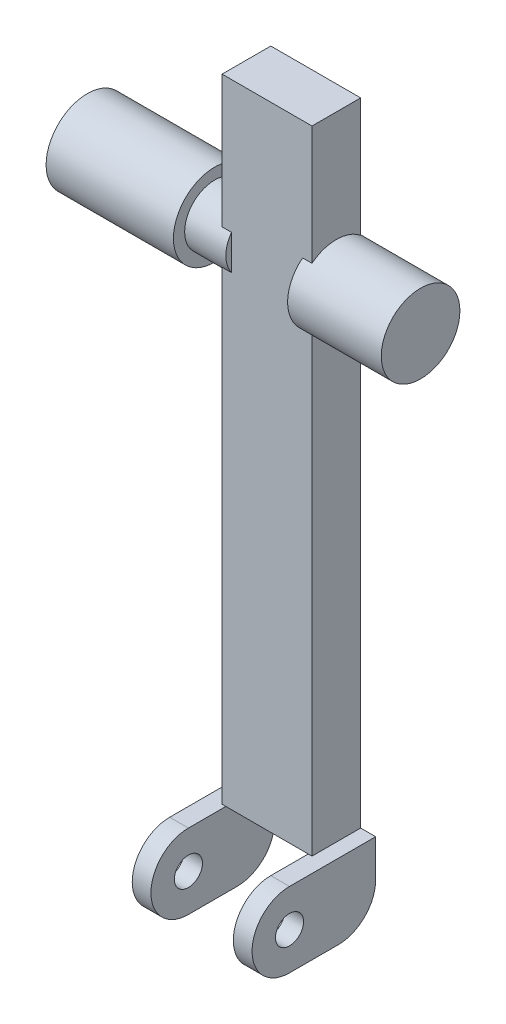
ISO-10303-21;
HEADER;
FILE_DESCRIPTION(('STEP AP214'),'2;1');
FILE_NAME('part.step','',(''),(''),'','','');
FILE_SCHEMA(('AUTOMOTIVE_DESIGN { 1 0 10303 214 1 1 1 1 }'));
ENDSEC;
DATA;
#1=APPLICATION_CONTEXT('core data for automotive mechanical design processes');
#2=APPLICATION_PROTOCOL_DEFINITION('international standard','automotive_design',2000,#1);
#3=PRODUCT_CONTEXT('',#1,'mechanical');
#4=PRODUCT('Part','Part','',(#3));
#5=PRODUCT_RELATED_PRODUCT_CATEGORY('part','',(#4));
#6=PRODUCT_DEFINITION_FORMATION('','',#4);
#7=PRODUCT_DEFINITION_CONTEXT('part definition',#1,'design');
#8=PRODUCT_DEFINITION('design','',#6,#7);
#9=PRODUCT_DEFINITION_SHAPE('','',#8);
#10=(LENGTH_UNIT() NAMED_UNIT(*) SI_UNIT(.MILLI.,.METRE.));
#11=(NAMED_UNIT(*) PLANE_ANGLE_UNIT() SI_UNIT($,.RADIAN.));
#12=(NAMED_UNIT(*) SI_UNIT($,.STERADIAN.) SOLID_ANGLE_UNIT());
#13=UNCERTAINTY_MEASURE_WITH_UNIT(LENGTH_MEASURE(1.E-05),#10,'distance_accuracy_value','');
#14=(GEOMETRIC_REPRESENTATION_CONTEXT(3) GLOBAL_UNCERTAINTY_ASSIGNED_CONTEXT((#13)) GLOBAL_UNIT_ASSIGNED_CONTEXT((#10,
#11,#12)) REPRESENTATION_CONTEXT('',''));
#15=CARTESIAN_POINT('',(0.,0.,0.));
#16=DIRECTION('',(0.,0.,1.));
#17=DIRECTION('',(1.,0.,0.));
#18=AXIS2_PLACEMENT_3D('',#15,#16,#17);
#19=CARTESIAN_POINT('',(22.,-257.72,-13.));
#20=DIRECTION('',(0.,0.,-1.));
#21=DIRECTION('',(0.,1.,0.));
#22=AXIS2_PLACEMENT_3D('',#19,#20,#21);
#23=PLANE('',#22);
#24=DIRECTION('',(1.,0.,0.));
#25=VECTOR('',#24,1.);
#26=CARTESIAN_POINT('',(22.,-257.72,-13.));
#27=LINE('',#26,#25);
#28=CARTESIAN_POINT('',(22.,-257.72,-13.));
#29=VERTEX_POINT('',#28);
#30=CARTESIAN_POINT('',(32.,-257.72,-13.));
#31=VERTEX_POINT('',#30);
#32=EDGE_CURVE('E45',#29,#31,#27,.T.);
#33=ORIENTED_EDGE('',*,*,#32,.T.);
#34=DIRECTION('',(0.,1.,0.));
#35=VECTOR('',#34,1.);
#36=CARTESIAN_POINT('',(32.,-257.72,-13.));
#37=LINE('',#36,#35);
#38=CARTESIAN_POINT('',(32.,-277.72,-13.));
#39=VERTEX_POINT('',#38);
#40=EDGE_CURVE('E88',#39,#31,#37,.T.);
#41=ORIENTED_EDGE('',*,*,#40,.F.);
#42=DIRECTION('',(1.,0.,0.));
#43=VECTOR('',#42,1.);
#44=CARTESIAN_POINT('',(22.,-277.72,-13.));
#45=LINE('',#44,#43);
#46=CARTESIAN_POINT('',(22.,-277.72,-13.));
#47=VERTEX_POINT('',#46);
#48=EDGE_CURVE('E12',#47,#39,#45,.T.);
#49=ORIENTED_EDGE('',*,*,#48,.F.);
#50=DIRECTION('',(0.,1.,0.));
#51=VECTOR('',#50,1.);
#52=CARTESIAN_POINT('',(22.,-257.72,-13.));
#53=LINE('',#52,#51);
#54=EDGE_CURVE('E89',#47,#29,#53,.T.);
#55=ORIENTED_EDGE('',*,*,#54,.T.);
#56=EDGE_LOOP('',(#33,#41,#49,#55));
#57=FACE_BOUND('',#56,.T.);
#58=ADVANCED_FACE('F42',(#57),#23,.T.);
#59=CARTESIAN_POINT('',(22.,-277.72,7.));
#60=DIRECTION('',(1.,0.,0.));
#61=DIRECTION('',(0.,0.,-1.));
#62=AXIS2_PLACEMENT_3D('',#59,#60,#61);
#63=CYLINDRICAL_SURFACE('',#62,20.);
#64=ORIENTED_EDGE('',*,*,#48,.T.);
#65=CARTESIAN_POINT('',(32.,-277.72,7.));
#66=DIRECTION('',(1.,0.,0.));
#67=DIRECTION('',(0.,0.,-1.));
#68=AXIS2_PLACEMENT_3D('',#65,#66,#67);
#69=CIRCLE('',#68,20.);
#70=CARTESIAN_POINT('',(32.,-297.72,7.));
#71=VERTEX_POINT('',#70);
#72=EDGE_CURVE('E106',#71,#39,#69,.T.);
#73=ORIENTED_EDGE('',*,*,#72,.F.);
#74=DIRECTION('',(1.,0.,0.));
#75=VECTOR('',#74,1.);
#76=CARTESIAN_POINT('',(22.,-297.72,7.));
#77=LINE('',#76,#75);
#78=CARTESIAN_POINT('',(22.,-297.72,7.));
#79=VERTEX_POINT('',#78);
#80=EDGE_CURVE('E50',#79,#71,#77,.T.);
#81=ORIENTED_EDGE('',*,*,#80,.F.);
#82=CARTESIAN_POINT('',(22.,-277.72,7.));
#83=DIRECTION('',(1.,0.,0.));
#84=DIRECTION('',(0.,0.,-1.));
#85=AXIS2_PLACEMENT_3D('',#82,#83,#84);
#86=CIRCLE('',#85,20.);
#87=EDGE_CURVE('E94',#79,#47,#86,.T.);
#88=ORIENTED_EDGE('',*,*,#87,.T.);
#89=EDGE_LOOP('',(#64,#73,#81,#88));
#90=FACE_BOUND('',#89,.T.);
#91=ADVANCED_FACE('F139',(#90),#63,.T.);
#92=CARTESIAN_POINT('',(22.,-297.72,7.));
#93=DIRECTION('',(0.,-1.,0.));
#94=DIRECTION('',(0.,0.,-1.));
#95=AXIS2_PLACEMENT_3D('',#92,#93,#94);
#96=PLANE('',#95);
#97=ORIENTED_EDGE('',*,*,#80,.T.);
#98=DIRECTION('',(0.,0.,-1.));
#99=VECTOR('',#98,1.);
#100=CARTESIAN_POINT('',(32.,-297.72,7.));
#101=LINE('',#100,#99);
#102=CARTESIAN_POINT('',(32.,-297.72,33.));
#103=VERTEX_POINT('',#102);
#104=EDGE_CURVE('E115',#103,#71,#101,.T.);
#105=ORIENTED_EDGE('',*,*,#104,.F.);
#106=DIRECTION('',(1.,0.,0.));
#107=VECTOR('',#106,1.);
#108=CARTESIAN_POINT('',(22.,-297.72,33.));
#109=LINE('',#108,#107);
#110=CARTESIAN_POINT('',(22.,-297.72,33.));
#111=VERTEX_POINT('',#110);
#112=EDGE_CURVE('E128',#111,#103,#109,.T.);
#113=ORIENTED_EDGE('',*,*,#112,.F.);
#114=DIRECTION('',(0.,0.,-1.));
#115=VECTOR('',#114,1.);
#116=CARTESIAN_POINT('',(22.,-297.72,7.));
#117=LINE('',#116,#115);
#118=EDGE_CURVE('E124',#111,#79,#117,.T.);
#119=ORIENTED_EDGE('',*,*,#118,.T.);
#120=EDGE_LOOP('',(#97,#105,#113,#119));
#121=FACE_BOUND('',#120,.T.);
#122=ADVANCED_FACE('F135',(#121),#96,.T.);
#123=CARTESIAN_POINT('',(22.,-277.72,33.));
#124=DIRECTION('',(1.,0.,0.));
#125=DIRECTION('',(0.,0.,-1.));
#126=AXIS2_PLACEMENT_3D('',#123,#124,#125);
#127=CYLINDRICAL_SURFACE('',#126,20.);
#128=ORIENTED_EDGE('',*,*,#112,.T.);
#129=CARTESIAN_POINT('',(32.,-277.72,33.));
#130=DIRECTION('',(1.,0.,0.));
#131=DIRECTION('',(0.,0.,-1.));
#132=AXIS2_PLACEMENT_3D('',#129,#130,#131);
#133=CIRCLE('',#132,20.);
#134=CARTESIAN_POINT('',(32.,-257.72,33.));
#135=VERTEX_POINT('',#134);
#136=EDGE_CURVE('E101',#135,#103,#133,.T.);
#137=ORIENTED_EDGE('',*,*,#136,.F.);
#138=DIRECTION('',(1.,0.,0.));
#139=VECTOR('',#138,1.);
#140=CARTESIAN_POINT('',(22.,-257.72,33.));
#141=LINE('',#140,#139);
#142=CARTESIAN_POINT('',(22.,-257.72,33.));
#143=VERTEX_POINT('',#142);
#144=EDGE_CURVE('E93',#143,#135,#141,.T.);
#145=ORIENTED_EDGE('',*,*,#144,.F.);
#146=CARTESIAN_POINT('',(22.,-277.72,33.));
#147=DIRECTION('',(1.,0.,0.));
#148=DIRECTION('',(0.,0.,-1.));
#149=AXIS2_PLACEMENT_3D('',#146,#147,#148);
#150=CIRCLE('',#149,20.);
#151=EDGE_CURVE('E121',#143,#111,#150,.T.);
#152=ORIENTED_EDGE('',*,*,#151,.T.);
#153=EDGE_LOOP('',(#128,#137,#145,#152));
#154=FACE_BOUND('',#153,.T.);
#155=ADVANCED_FACE('F130',(#154),#127,.T.);
#156=CARTESIAN_POINT('',(22.,-257.72,-13.));
#157=DIRECTION('',(0.,1.,0.));
#158=DIRECTION('',(0.,0.,1.));
#159=AXIS2_PLACEMENT_3D('',#156,#157,#158);
#160=PLANE('',#159);
#161=ORIENTED_EDGE('',*,*,#144,.T.);
#162=DIRECTION('',(0.,0.,1.));
#163=VECTOR('',#162,1.);
#164=CARTESIAN_POINT('',(32.,-257.72,-13.));
#165=LINE('',#164,#163);
#166=EDGE_CURVE('E96',#31,#135,#165,.T.);
#167=ORIENTED_EDGE('',*,*,#166,.F.);
#168=ORIENTED_EDGE('',*,*,#32,.F.);
#169=DIRECTION('',(0.,0.,1.));
#170=VECTOR('',#169,1.);
#171=CARTESIAN_POINT('',(22.,-257.72,-13.));
#172=LINE('',#171,#170);
#173=EDGE_CURVE('E119',#29,#143,#172,.T.);
#174=ORIENTED_EDGE('',*,*,#173,.T.);
#175=EDGE_LOOP('',(#161,#167,#168,#174));
#176=FACE_BOUND('',#175,.T.);
#177=ADVANCED_FACE('F97',(#176),#160,.T.);
#178=CARTESIAN_POINT('',(22.,-277.72,7.));
#179=DIRECTION('',(1.,0.,0.));
#180=DIRECTION('',(0.,0.,-1.));
#181=AXIS2_PLACEMENT_3D('',#178,#179,#180);
#182=PLANE('',#181);
#183=CARTESIAN_POINT('',(22.,-277.72,33.));
#184=DIRECTION('',(-1.,0.,0.));
#185=DIRECTION('',(0.,0.,1.));
#186=AXIS2_PLACEMENT_3D('',#183,#184,#185);
#187=CIRCLE('',#186,7.5);
#188=CARTESIAN_POINT('',(22.,-277.72,40.5));
#189=VERTEX_POINT('',#188);
#190=EDGE_CURVE('E110',#189,#189,#187,.T.);
#191=ORIENTED_EDGE('',*,*,#190,.F.);
#192=EDGE_LOOP('',(#191));
#193=FACE_BOUND('',#192,.T.);
#194=ORIENTED_EDGE('',*,*,#54,.F.);
#195=ORIENTED_EDGE('',*,*,#87,.F.);
#196=ORIENTED_EDGE('',*,*,#118,.F.);
#197=ORIENTED_EDGE('',*,*,#151,.F.);
#198=ORIENTED_EDGE('',*,*,#173,.F.);
#199=EDGE_LOOP('',(#194,#195,#196,#197,#198));
#200=FACE_BOUND('',#199,.T.);
#201=ADVANCED_FACE('F138',(#193,#200),#182,.F.);
#202=CARTESIAN_POINT('',(32.,-277.72,7.));
#203=DIRECTION('',(1.,0.,0.));
#204=DIRECTION('',(0.,0.,-1.));
#205=AXIS2_PLACEMENT_3D('',#202,#203,#204);
#206=PLANE('',#205);
#207=CARTESIAN_POINT('',(32.,-277.72,33.));
#208=DIRECTION('',(-1.,0.,0.));
#209=DIRECTION('',(0.,0.,1.));
#210=AXIS2_PLACEMENT_3D('',#207,#208,#209);
#211=CIRCLE('',#210,7.5);
#212=CARTESIAN_POINT('',(32.,-277.72,40.5));
#213=VERTEX_POINT('',#212);
#214=EDGE_CURVE('E107',#213,#213,#211,.T.);
#215=ORIENTED_EDGE('',*,*,#214,.T.);
#216=EDGE_LOOP('',(#215));
#217=FACE_BOUND('',#216,.T.);
#218=ORIENTED_EDGE('',*,*,#40,.T.);
#219=ORIENTED_EDGE('',*,*,#166,.T.);
#220=ORIENTED_EDGE('',*,*,#136,.T.);
#221=ORIENTED_EDGE('',*,*,#104,.T.);
#222=ORIENTED_EDGE('',*,*,#72,.T.);
#223=EDGE_LOOP('',(#218,#219,#220,#221,#222));
#224=FACE_BOUND('',#223,.T.);
#225=ADVANCED_FACE('F104',(#217,#224),#206,.T.);
#226=CARTESIAN_POINT('',(32.,-277.72,33.));
#227=DIRECTION('',(-1.,0.,0.));
#228=DIRECTION('',(0.,0.,1.));
#229=AXIS2_PLACEMENT_3D('',#226,#227,#228);
#230=CYLINDRICAL_SURFACE('',#229,7.5);
#231=ORIENTED_EDGE('',*,*,#214,.F.);
#232=EDGE_LOOP('',(#231));
#233=FACE_BOUND('',#232,.T.);
#234=ORIENTED_EDGE('',*,*,#190,.T.);
#235=EDGE_LOOP('',(#234));
#236=FACE_BOUND('',#235,.T.);
#237=ADVANCED_FACE('F159',(#233,#236),#230,.F.);
#238=CLOSED_SHELL('',(#58,#91,#122,#155,#177,#201,#225,#237));
#239=MANIFOLD_SOLID_BREP('B2',#238);
#240=CARTESIAN_POINT('',(0.,-257.72,0.));
#241=DIRECTION('',(0.,1.,0.));
#242=DIRECTION('',(0.,0.,1.));
#243=AXIS2_PLACEMENT_3D('',#240,#241,#242);
#244=PLANE('',#243);
#245=DIRECTION('',(0.,0.,1.));
#246=VECTOR('',#245,1.);
#247=CARTESIAN_POINT('',(-22.,-257.72,-13.));
#248=LINE('',#247,#246);
#249=CARTESIAN_POINT('',(-22.,-257.72,-13.));
#250=VERTEX_POINT('',#249);
#251=CARTESIAN_POINT('',(-22.,-257.72,13.));
#252=VERTEX_POINT('',#251);
#253=EDGE_CURVE('E227',#250,#252,#248,.T.);
#254=ORIENTED_EDGE('',*,*,#253,.F.);
#255=DIRECTION('',(-1.,0.,0.));
#256=VECTOR('',#255,1.);
#257=CARTESIAN_POINT('',(-24.,-257.72,-13.));
#258=LINE('',#257,#256);
#259=CARTESIAN_POINT('',(24.,-257.72,-13.));
#260=VERTEX_POINT('',#259);
#261=EDGE_CURVE('E431',#260,#250,#258,.T.);
#262=ORIENTED_EDGE('',*,*,#261,.F.);
#263=DIRECTION('',(0.,0.,-1.));
#264=VECTOR('',#263,1.);
#265=CARTESIAN_POINT('',(24.,-257.72,-13.));
#266=LINE('',#265,#264);
#267=CARTESIAN_POINT('',(24.,-257.72,13.));
#268=VERTEX_POINT('',#267);
#269=EDGE_CURVE('E428',#268,#260,#266,.T.);
#270=ORIENTED_EDGE('',*,*,#269,.F.);
#271=DIRECTION('',(1.,0.,0.));
#272=VECTOR('',#271,1.);
#273=CARTESIAN_POINT('',(-24.,-257.72,13.));
#274=LINE('',#273,#272);
#275=EDGE_CURVE('E434',#252,#268,#274,.T.);
#276=ORIENTED_EDGE('',*,*,#275,.F.);
#277=EDGE_LOOP('',(#254,#262,#270,#276));
#278=FACE_BOUND('',#277,.T.);
#279=ADVANCED_FACE('F212',(#278),#244,.F.);
#280=CARTESIAN_POINT('',(24.,-257.72,-13.));
#281=DIRECTION('',(1.,0.,0.));
#282=DIRECTION('',(0.,0.,-1.));
#283=AXIS2_PLACEMENT_3D('',#280,#281,#282);
#284=PLANE('',#283);
#285=DIRECTION('',(0.,1.,0.));
#286=VECTOR('',#285,1.);
#287=CARTESIAN_POINT('',(24.,-257.72,-13.));
#288=LINE('',#287,#286);
#289=CARTESIAN_POINT('',(24.,-16.4924225024707,-13.));
#290=VERTEX_POINT('',#289);
#291=EDGE_CURVE('E450',#260,#290,#288,.T.);
#292=ORIENTED_EDGE('',*,*,#291,.T.);
#293=CARTESIAN_POINT('',(24.,0.,0.));
#294=DIRECTION('',(1.,0.,0.));
#295=DIRECTION('',(0.,0.,-1.));
#296=AXIS2_PLACEMENT_3D('',#293,#294,#295);
#297=CIRCLE('',#296,21.);
#298=CARTESIAN_POINT('',(24.,-16.4924225024706,13.));
#299=VERTEX_POINT('',#298);
#300=EDGE_CURVE('E410',#290,#299,#297,.F.);
#301=ORIENTED_EDGE('',*,*,#300,.T.);
#302=DIRECTION('',(0.,1.,0.));
#303=VECTOR('',#302,1.);
#304=CARTESIAN_POINT('',(24.,-257.72,13.));
#305=LINE('',#304,#303);
#306=EDGE_CURVE('E438',#268,#299,#305,.T.);
#307=ORIENTED_EDGE('',*,*,#306,.F.);
#308=ORIENTED_EDGE('',*,*,#269,.T.);
#309=EDGE_LOOP('',(#292,#301,#307,#308));
#310=FACE_BOUND('',#309,.T.);
#311=ADVANCED_FACE('F527',(#310),#284,.T.);
#312=CARTESIAN_POINT('',(24.,16.4924225024706,13.));
#313=VERTEX_POINT('',#312);
#314=CARTESIAN_POINT('',(24.,80.,13.));
#315=VERTEX_POINT('',#314);
#316=EDGE_CURVE('E442',#313,#315,#305,.T.);
#317=ORIENTED_EDGE('',*,*,#316,.F.);
#318=CARTESIAN_POINT('',(24.,16.4924225024707,-13.));
#319=VERTEX_POINT('',#318);
#320=EDGE_CURVE('E406',#313,#319,#297,.F.);
#321=ORIENTED_EDGE('',*,*,#320,.T.);
#322=CARTESIAN_POINT('',(24.,80.,-13.));
#323=VERTEX_POINT('',#322);
#324=EDGE_CURVE('E437',#319,#323,#288,.T.);
#325=ORIENTED_EDGE('',*,*,#324,.T.);
#326=DIRECTION('',(0.,0.,-1.));
#327=VECTOR('',#326,1.);
#328=CARTESIAN_POINT('',(24.,80.,-13.));
#329=LINE('',#328,#327);
#330=EDGE_CURVE('E416',#315,#323,#329,.T.);
#331=ORIENTED_EDGE('',*,*,#330,.F.);
#332=EDGE_LOOP('',(#317,#321,#325,#331));
#333=FACE_BOUND('',#332,.T.);
#334=ADVANCED_FACE('F495',(#333),#284,.T.);
#335=CARTESIAN_POINT('',(-24.,-257.72,13.));
#336=DIRECTION('',(0.,0.,1.));
#337=DIRECTION('',(1.,0.,0.));
#338=AXIS2_PLACEMENT_3D('',#335,#336,#337);
#339=PLANE('',#338);
#340=DIRECTION('',(0.,1.,0.));
#341=VECTOR('',#340,1.);
#342=CARTESIAN_POINT('',(19.,-257.72,13.));
#343=LINE('',#342,#341);
#344=CARTESIAN_POINT('',(19.,-16.4924225024706,13.));
#345=VERTEX_POINT('',#344);
#346=CARTESIAN_POINT('',(19.,16.4924225024706,13.));
#347=VERTEX_POINT('',#346);
#348=EDGE_CURVE('E401',#345,#347,#343,.T.);
#349=ORIENTED_EDGE('',*,*,#348,.T.);
#350=DIRECTION('',(-1.,0.,0.));
#351=VECTOR('',#350,1.);
#352=CARTESIAN_POINT('',(69.,16.4924225024706,13.));
#353=LINE('',#352,#351);
#354=EDGE_CURVE('E409',#347,#313,#353,.F.);
#355=ORIENTED_EDGE('',*,*,#354,.T.);
#356=ORIENTED_EDGE('',*,*,#316,.T.);
#357=DIRECTION('',(1.,0.,0.));
#358=VECTOR('',#357,1.);
#359=CARTESIAN_POINT('',(-24.,80.,13.));
#360=LINE('',#359,#358);
#361=CARTESIAN_POINT('',(-24.,80.,13.));
#362=VERTEX_POINT('',#361);
#363=EDGE_CURVE('E425',#362,#315,#360,.T.);
#364=ORIENTED_EDGE('',*,*,#363,.F.);
#365=DIRECTION('',(0.,1.,0.));
#366=VECTOR('',#365,1.);
#367=CARTESIAN_POINT('',(-24.,-257.72,13.));
#368=LINE('',#367,#366);
#369=CARTESIAN_POINT('',(-24.,9.3273790530888,13.));
#370=VERTEX_POINT('',#369);
#371=EDGE_CURVE('E446',#370,#362,#368,.T.);
#372=ORIENTED_EDGE('',*,*,#371,.F.);
#373=DIRECTION('',(1.,0.,0.));
#374=VECTOR('',#373,1.);
#375=CARTESIAN_POINT('',(-41.,9.3273790530888,13.));
#376=LINE('',#375,#374);
#377=CARTESIAN_POINT('',(-19.,9.3273790530888,13.));
#378=VERTEX_POINT('',#377);
#379=EDGE_CURVE('E458',#370,#378,#376,.T.);
#380=ORIENTED_EDGE('',*,*,#379,.T.);
#381=DIRECTION('',(0.,-1.,0.));
#382=VECTOR('',#381,1.);
#383=CARTESIAN_POINT('',(-19.,0.,13.));
#384=LINE('',#383,#382);
#385=CARTESIAN_POINT('',(-19.,-9.3273790530888,13.));
#386=VERTEX_POINT('',#385);
#387=EDGE_CURVE('E479',#378,#386,#384,.T.);
#388=ORIENTED_EDGE('',*,*,#387,.T.);
#389=DIRECTION('',(1.,0.,0.));
#390=VECTOR('',#389,1.);
#391=CARTESIAN_POINT('',(-41.,-9.3273790530888,13.));
#392=LINE('',#391,#390);
#393=CARTESIAN_POINT('',(-24.,-9.3273790530888,13.));
#394=VERTEX_POINT('',#393);
#395=EDGE_CURVE('E461',#386,#394,#392,.F.);
#396=ORIENTED_EDGE('',*,*,#395,.T.);
#397=CARTESIAN_POINT('',(-24.,-257.72,13.));
#398=VERTEX_POINT('',#397);
#399=EDGE_CURVE('E443',#398,#394,#368,.T.);
#400=ORIENTED_EDGE('',*,*,#399,.F.);
#401=EDGE_CURVE('E435',#398,#252,#274,.T.);
#402=ORIENTED_EDGE('',*,*,#401,.T.);
#403=ORIENTED_EDGE('',*,*,#275,.T.);
#404=ORIENTED_EDGE('',*,*,#306,.T.);
#405=DIRECTION('',(-1.,0.,0.));
#406=VECTOR('',#405,1.);
#407=CARTESIAN_POINT('',(69.,-16.4924225024706,13.));
#408=LINE('',#407,#406);
#409=EDGE_CURVE('E413',#299,#345,#408,.T.);
#410=ORIENTED_EDGE('',*,*,#409,.T.);
#411=EDGE_LOOP('',(#349,#355,#356,#364,#372,#380,#388,#396,#400,#402,#403,#404,#410));
#412=FACE_BOUND('',#411,.T.);
#413=ADVANCED_FACE('F499',(#412),#339,.T.);
#414=CARTESIAN_POINT('',(-24.,-257.72,-13.));
#415=DIRECTION('',(0.,0.,-1.));
#416=DIRECTION('',(-1.,0.,0.));
#417=AXIS2_PLACEMENT_3D('',#414,#415,#416);
#418=PLANE('',#417);
#419=DIRECTION('',(0.,-1.,0.));
#420=VECTOR('',#419,1.);
#421=CARTESIAN_POINT('',(19.,-257.72,-13.));
#422=LINE('',#421,#420);
#423=CARTESIAN_POINT('',(19.,16.4924225024707,-13.));
#424=VERTEX_POINT('',#423);
#425=CARTESIAN_POINT('',(19.,-16.4924225024707,-13.));
#426=VERTEX_POINT('',#425);
#427=EDGE_CURVE('E486',#424,#426,#422,.T.);
#428=ORIENTED_EDGE('',*,*,#427,.T.);
#429=DIRECTION('',(-1.,0.,0.));
#430=VECTOR('',#429,1.);
#431=CARTESIAN_POINT('',(69.,-16.4924225024707,-13.));
#432=LINE('',#431,#430);
#433=EDGE_CURVE('E40',#426,#290,#432,.F.);
#434=ORIENTED_EDGE('',*,*,#433,.T.);
#435=ORIENTED_EDGE('',*,*,#291,.F.);
#436=ORIENTED_EDGE('',*,*,#261,.T.);
#437=DIRECTION('',(0.,1.,0.));
#438=VECTOR('',#437,1.);
#439=CARTESIAN_POINT('',(-22.,-257.72,-13.));
#440=LINE('',#439,#438);
#441=CARTESIAN_POINT('',(-22.,-277.72,-13.));
#442=VERTEX_POINT('',#441);
#443=EDGE_CURVE('E368',#442,#250,#440,.T.);
#444=ORIENTED_EDGE('',*,*,#443,.F.);
#445=DIRECTION('',(-1.,0.,0.));
#446=VECTOR('',#445,1.);
#447=CARTESIAN_POINT('',(-22.,-277.72,-13.));
#448=LINE('',#447,#446);
#449=CARTESIAN_POINT('',(-32.,-277.72,-13.));
#450=VERTEX_POINT('',#449);
#451=EDGE_CURVE('E366',#442,#450,#448,.T.);
#452=ORIENTED_EDGE('',*,*,#451,.T.);
#453=DIRECTION('',(0.,1.,0.));
#454=VECTOR('',#453,1.);
#455=CARTESIAN_POINT('',(-32.,-257.72,-13.));
#456=LINE('',#455,#454);
#457=CARTESIAN_POINT('',(-32.,-257.72,-13.));
#458=VERTEX_POINT('',#457);
#459=EDGE_CURVE('E349',#450,#458,#456,.T.);
#460=ORIENTED_EDGE('',*,*,#459,.T.);
#461=DIRECTION('',(-1.,0.,0.));
#462=VECTOR('',#461,1.);
#463=CARTESIAN_POINT('',(-22.,-257.72,-13.));
#464=LINE('',#463,#462);
#465=CARTESIAN_POINT('',(-24.,-257.72,-13.));
#466=VERTEX_POINT('',#465);
#467=EDGE_CURVE('E336',#466,#458,#464,.T.);
#468=ORIENTED_EDGE('',*,*,#467,.F.);
#469=DIRECTION('',(0.,1.,0.));
#470=VECTOR('',#469,1.);
#471=CARTESIAN_POINT('',(-24.,-257.72,-13.));
#472=LINE('',#471,#470);
#473=CARTESIAN_POINT('',(-24.,-9.32737905308883,-13.));
#474=VERTEX_POINT('',#473);
#475=EDGE_CURVE('E447',#466,#474,#472,.T.);
#476=ORIENTED_EDGE('',*,*,#475,.T.);
#477=DIRECTION('',(1.,0.,0.));
#478=VECTOR('',#477,1.);
#479=CARTESIAN_POINT('',(-41.,-9.32737905308883,-13.));
#480=LINE('',#479,#478);
#481=CARTESIAN_POINT('',(-19.,-9.32737905308883,-13.));
#482=VERTEX_POINT('',#481);
#483=EDGE_CURVE('E441',#474,#482,#480,.T.);
#484=ORIENTED_EDGE('',*,*,#483,.T.);
#485=DIRECTION('',(0.,1.,0.));
#486=VECTOR('',#485,1.);
#487=CARTESIAN_POINT('',(-19.,0.,-13.));
#488=LINE('',#487,#486);
#489=CARTESIAN_POINT('',(-19.,9.32737905308883,-13.));
#490=VERTEX_POINT('',#489);
#491=EDGE_CURVE('E476',#482,#490,#488,.T.);
#492=ORIENTED_EDGE('',*,*,#491,.T.);
#493=DIRECTION('',(1.,0.,0.));
#494=VECTOR('',#493,1.);
#495=CARTESIAN_POINT('',(-41.,9.32737905308883,-13.));
#496=LINE('',#495,#494);
#497=CARTESIAN_POINT('',(-24.,9.32737905308883,-13.));
#498=VERTEX_POINT('',#497);
#499=EDGE_CURVE('E455',#490,#498,#496,.F.);
#500=ORIENTED_EDGE('',*,*,#499,.T.);
#501=CARTESIAN_POINT('',(-24.,80.,-13.));
#502=VERTEX_POINT('',#501);
#503=EDGE_CURVE('E449',#498,#502,#472,.T.);
#504=ORIENTED_EDGE('',*,*,#503,.T.);
#505=DIRECTION('',(-1.,0.,0.));
#506=VECTOR('',#505,1.);
#507=CARTESIAN_POINT('',(-24.,80.,-13.));
#508=LINE('',#507,#506);
#509=EDGE_CURVE('E419',#323,#502,#508,.T.);
#510=ORIENTED_EDGE('',*,*,#509,.F.);
#511=ORIENTED_EDGE('',*,*,#324,.F.);
#512=DIRECTION('',(-1.,0.,0.));
#513=VECTOR('',#512,1.);
#514=CARTESIAN_POINT('',(69.,16.4924225024707,-13.));
#515=LINE('',#514,#513);
#516=EDGE_CURVE('E220',#319,#424,#515,.T.);
#517=ORIENTED_EDGE('',*,*,#516,.T.);
#518=EDGE_LOOP('',(#428,#434,#435,#436,#444,#452,#460,#468,#476,#484,#492,#500,#504,#510,#511,#517));
#519=FACE_BOUND('',#518,.T.);
#520=ADVANCED_FACE('F363',(#519),#418,.T.);
#521=CARTESIAN_POINT('',(-19.,0.,0.));
#522=DIRECTION('',(1.,0.,0.));
#523=DIRECTION('',(0.,0.,-1.));
#524=AXIS2_PLACEMENT_3D('',#521,#522,#523);
#525=PLANE('',#524);
#526=ORIENTED_EDGE('',*,*,#387,.F.);
#527=CARTESIAN_POINT('',(-19.,0.,0.));
#528=DIRECTION('',(1.,0.,0.));
#529=DIRECTION('',(0.,0.,-1.));
#530=AXIS2_PLACEMENT_3D('',#527,#528,#529);
#531=CIRCLE('',#530,16.);
#532=EDGE_CURVE('E475',#378,#386,#531,.T.);
#533=ORIENTED_EDGE('',*,*,#532,.T.);
#534=EDGE_LOOP('',(#526,#533));
#535=FACE_BOUND('',#534,.T.);
#536=ADVANCED_FACE('F514',(#535),#525,.T.);
#537=CARTESIAN_POINT('',(-41.,0.,0.));
#538=DIRECTION('',(1.,0.,0.));
#539=DIRECTION('',(0.,0.,-1.));
#540=AXIS2_PLACEMENT_3D('',#537,#538,#539);
#541=CYLINDRICAL_SURFACE('',#540,16.);
#542=ORIENTED_EDGE('',*,*,#379,.F.);
#543=CARTESIAN_POINT('',(-24.,0.,0.));
#544=DIRECTION('',(-1.,0.,0.));
#545=DIRECTION('',(0.,0.,1.));
#546=AXIS2_PLACEMENT_3D('',#543,#544,#545);
#547=CIRCLE('',#546,16.);
#548=EDGE_CURVE('E485',#498,#370,#547,.F.);
#549=ORIENTED_EDGE('',*,*,#548,.F.);
#550=ORIENTED_EDGE('',*,*,#499,.F.);
#551=EDGE_CURVE('E473',#482,#490,#531,.T.);
#552=ORIENTED_EDGE('',*,*,#551,.F.);
#553=ORIENTED_EDGE('',*,*,#483,.F.);
#554=EDGE_CURVE('E482',#394,#474,#547,.F.);
#555=ORIENTED_EDGE('',*,*,#554,.F.);
#556=ORIENTED_EDGE('',*,*,#395,.F.);
#557=ORIENTED_EDGE('',*,*,#532,.F.);
#558=EDGE_LOOP('',(#542,#549,#550,#552,#553,#555,#556,#557));
#559=FACE_BOUND('',#558,.T.);
#560=CARTESIAN_POINT('',(-41.,0.,0.));
#561=DIRECTION('',(-1.,0.,0.));
#562=DIRECTION('',(0.,0.,1.));
#563=AXIS2_PLACEMENT_3D('',#560,#561,#562);
#564=CIRCLE('',#563,16.);
#565=CARTESIAN_POINT('',(-41.,0.,16.));
#566=VERTEX_POINT('',#565);
#567=EDGE_CURVE('E468',#566,#566,#564,.F.);
#568=ORIENTED_EDGE('',*,*,#567,.T.);
#569=EDGE_LOOP('',(#568));
#570=FACE_BOUND('',#569,.T.);
#571=ADVANCED_FACE('F214',(#559,#570),#541,.T.);
#572=ORIENTED_EDGE('',*,*,#491,.F.);
#573=ORIENTED_EDGE('',*,*,#551,.T.);
#574=EDGE_LOOP('',(#572,#573));
#575=FACE_BOUND('',#574,.T.);
#576=ADVANCED_FACE('F516',(#575),#525,.T.);
#577=CARTESIAN_POINT('',(-109.,0.,0.));
#578=DIRECTION('',(1.,0.,0.));
#579=DIRECTION('',(0.,0.,-1.));
#580=AXIS2_PLACEMENT_3D('',#577,#578,#579);
#581=CYLINDRICAL_SURFACE('',#580,22.);
#582=CARTESIAN_POINT('',(-109.,0.,0.));
#583=DIRECTION('',(-1.,0.,0.));
#584=DIRECTION('',(0.,0.,1.));
#585=AXIS2_PLACEMENT_3D('',#582,#583,#584);
#586=CIRCLE('',#585,22.);
#587=CARTESIAN_POINT('',(-109.,0.,22.));
#588=VERTEX_POINT('',#587);
#589=EDGE_CURVE('E465',#588,#588,#586,.T.);
#590=ORIENTED_EDGE('',*,*,#589,.F.);
#591=EDGE_LOOP('',(#590));
#592=FACE_BOUND('',#591,.T.);
#593=CARTESIAN_POINT('',(-41.,0.,0.));
#594=DIRECTION('',(-1.,0.,0.));
#595=DIRECTION('',(0.,0.,1.));
#596=AXIS2_PLACEMENT_3D('',#593,#594,#595);
#597=CIRCLE('',#596,22.);
#598=CARTESIAN_POINT('',(-41.,0.,22.));
#599=VERTEX_POINT('',#598);
#600=EDGE_CURVE('E464',#599,#599,#597,.T.);
#601=ORIENTED_EDGE('',*,*,#600,.T.);
#602=EDGE_LOOP('',(#601));
#603=FACE_BOUND('',#602,.T.);
#604=ADVANCED_FACE('F524',(#592,#603),#581,.T.);
#605=CARTESIAN_POINT('',(-109.,0.,0.));
#606=DIRECTION('',(-1.,0.,0.));
#607=DIRECTION('',(0.,0.,1.));
#608=AXIS2_PLACEMENT_3D('',#605,#606,#607);
#609=PLANE('',#608);
#610=ORIENTED_EDGE('',*,*,#589,.T.);
#611=EDGE_LOOP('',(#610));
#612=FACE_BOUND('',#611,.T.);
#613=ADVANCED_FACE('F542',(#612),#609,.T.);
#614=CARTESIAN_POINT('',(-41.,0.,0.));
#615=DIRECTION('',(-1.,0.,0.));
#616=DIRECTION('',(0.,0.,1.));
#617=AXIS2_PLACEMENT_3D('',#614,#615,#616);
#618=PLANE('',#617);
#619=ORIENTED_EDGE('',*,*,#567,.F.);
#620=EDGE_LOOP('',(#619));
#621=FACE_BOUND('',#620,.T.);
#622=ORIENTED_EDGE('',*,*,#600,.F.);
#623=EDGE_LOOP('',(#622));
#624=FACE_BOUND('',#623,.T.);
#625=ADVANCED_FACE('F545',(#621,#624),#618,.F.);
#626=CARTESIAN_POINT('',(-24.,-257.72,-13.));
#627=DIRECTION('',(-1.,0.,0.));
#628=DIRECTION('',(0.,0.,1.));
#629=AXIS2_PLACEMENT_3D('',#626,#627,#628);
#630=PLANE('',#629);
#631=ORIENTED_EDGE('',*,*,#399,.T.);
#632=ORIENTED_EDGE('',*,*,#554,.T.);
#633=ORIENTED_EDGE('',*,*,#475,.F.);
#634=DIRECTION('',(0.,0.,1.));
#635=VECTOR('',#634,1.);
#636=CARTESIAN_POINT('',(-24.,-257.72,-13.));
#637=LINE('',#636,#635);
#638=EDGE_CURVE('E345',#466,#398,#637,.T.);
#639=ORIENTED_EDGE('',*,*,#638,.T.);
#640=EDGE_LOOP('',(#631,#632,#633,#639));
#641=FACE_BOUND('',#640,.T.);
#642=ADVANCED_FACE('F540',(#641),#630,.T.);
#643=ORIENTED_EDGE('',*,*,#503,.F.);
#644=ORIENTED_EDGE('',*,*,#548,.T.);
#645=ORIENTED_EDGE('',*,*,#371,.T.);
#646=DIRECTION('',(0.,0.,1.));
#647=VECTOR('',#646,1.);
#648=CARTESIAN_POINT('',(-24.,80.,-13.));
#649=LINE('',#648,#647);
#650=EDGE_CURVE('E422',#502,#362,#649,.T.);
#651=ORIENTED_EDGE('',*,*,#650,.F.);
#652=EDGE_LOOP('',(#643,#644,#645,#651));
#653=FACE_BOUND('',#652,.T.);
#654=ADVANCED_FACE('F506',(#653),#630,.T.);
#655=CARTESIAN_POINT('',(0.,80.,0.));
#656=DIRECTION('',(0.,1.,0.));
#657=DIRECTION('',(0.,0.,1.));
#658=AXIS2_PLACEMENT_3D('',#655,#656,#657);
#659=PLANE('',#658);
#660=ORIENTED_EDGE('',*,*,#330,.T.);
#661=ORIENTED_EDGE('',*,*,#509,.T.);
#662=ORIENTED_EDGE('',*,*,#650,.T.);
#663=ORIENTED_EDGE('',*,*,#363,.T.);
#664=EDGE_LOOP('',(#660,#661,#662,#663));
#665=FACE_BOUND('',#664,.T.);
#666=ADVANCED_FACE('F502',(#665),#659,.T.);
#667=CARTESIAN_POINT('',(19.,0.,0.));
#668=DIRECTION('',(1.,0.,0.));
#669=DIRECTION('',(0.,0.,-1.));
#670=AXIS2_PLACEMENT_3D('',#667,#668,#669);
#671=PLANE('',#670);
#672=ORIENTED_EDGE('',*,*,#348,.F.);
#673=CARTESIAN_POINT('',(19.,0.,0.));
#674=DIRECTION('',(1.,0.,0.));
#675=DIRECTION('',(0.,0.,-1.));
#676=AXIS2_PLACEMENT_3D('',#673,#674,#675);
#677=CIRCLE('',#676,21.);
#678=EDGE_CURVE('E402',#347,#345,#677,.T.);
#679=ORIENTED_EDGE('',*,*,#678,.F.);
#680=EDGE_LOOP('',(#672,#679));
#681=FACE_BOUND('',#680,.T.);
#682=ADVANCED_FACE('F586',(#681),#671,.F.);
#683=CARTESIAN_POINT('',(69.,0.,0.));
#684=DIRECTION('',(-1.,0.,0.));
#685=DIRECTION('',(0.,0.,1.));
#686=AXIS2_PLACEMENT_3D('',#683,#684,#685);
#687=CYLINDRICAL_SURFACE('',#686,21.);
#688=ORIENTED_EDGE('',*,*,#409,.F.);
#689=ORIENTED_EDGE('',*,*,#300,.F.);
#690=ORIENTED_EDGE('',*,*,#433,.F.);
#691=EDGE_CURVE('E234',#426,#424,#677,.T.);
#692=ORIENTED_EDGE('',*,*,#691,.T.);
#693=ORIENTED_EDGE('',*,*,#516,.F.);
#694=ORIENTED_EDGE('',*,*,#320,.F.);
#695=ORIENTED_EDGE('',*,*,#354,.F.);
#696=ORIENTED_EDGE('',*,*,#678,.T.);
#697=EDGE_LOOP('',(#688,#689,#690,#692,#693,#694,#695,#696));
#698=FACE_BOUND('',#697,.T.);
#699=CARTESIAN_POINT('',(69.,0.,0.));
#700=DIRECTION('',(1.,0.,0.));
#701=DIRECTION('',(0.,0.,-1.));
#702=AXIS2_PLACEMENT_3D('',#699,#700,#701);
#703=CIRCLE('',#702,21.);
#704=CARTESIAN_POINT('',(69.,0.,-21.));
#705=VERTEX_POINT('',#704);
#706=EDGE_CURVE('E398',#705,#705,#703,.T.);
#707=ORIENTED_EDGE('',*,*,#706,.F.);
#708=EDGE_LOOP('',(#707));
#709=FACE_BOUND('',#708,.T.);
#710=ADVANCED_FACE('F491',(#698,#709),#687,.T.);
#711=CARTESIAN_POINT('',(69.,0.,0.));
#712=DIRECTION('',(1.,0.,0.));
#713=DIRECTION('',(0.,0.,-1.));
#714=AXIS2_PLACEMENT_3D('',#711,#712,#713);
#715=PLANE('',#714);
#716=ORIENTED_EDGE('',*,*,#706,.T.);
#717=EDGE_LOOP('',(#716));
#718=FACE_BOUND('',#717,.T.);
#719=ADVANCED_FACE('F600',(#718),#715,.T.);
#720=ORIENTED_EDGE('',*,*,#427,.F.);
#721=ORIENTED_EDGE('',*,*,#691,.F.);
#722=EDGE_LOOP('',(#720,#721));
#723=FACE_BOUND('',#722,.T.);
#724=ADVANCED_FACE('F594',(#723),#671,.F.);
#725=CARTESIAN_POINT('',(-22.,-277.72,7.));
#726=DIRECTION('',(-1.,0.,0.));
#727=DIRECTION('',(0.,0.,-1.));
#728=AXIS2_PLACEMENT_3D('',#725,#726,#727);
#729=CYLINDRICAL_SURFACE('',#728,20.);
#730=ORIENTED_EDGE('',*,*,#451,.F.);
#731=CARTESIAN_POINT('',(-22.,-277.72,7.));
#732=DIRECTION('',(1.,0.,0.));
#733=DIRECTION('',(0.,0.,-1.));
#734=AXIS2_PLACEMENT_3D('',#731,#732,#733);
#735=CIRCLE('',#734,20.);
#736=CARTESIAN_POINT('',(-22.,-297.72,7.));
#737=VERTEX_POINT('',#736);
#738=EDGE_CURVE('E378',#737,#442,#735,.T.);
#739=ORIENTED_EDGE('',*,*,#738,.F.);
#740=DIRECTION('',(-1.,0.,0.));
#741=VECTOR('',#740,1.);
#742=CARTESIAN_POINT('',(-22.,-297.72,7.));
#743=LINE('',#742,#741);
#744=CARTESIAN_POINT('',(-32.,-297.72,7.));
#745=VERTEX_POINT('',#744);
#746=EDGE_CURVE('E375',#737,#745,#743,.T.);
#747=ORIENTED_EDGE('',*,*,#746,.T.);
#748=CARTESIAN_POINT('',(-32.,-277.72,7.));
#749=DIRECTION('',(1.,0.,0.));
#750=DIRECTION('',(0.,0.,-1.));
#751=AXIS2_PLACEMENT_3D('',#748,#749,#750);
#752=CIRCLE('',#751,20.);
#753=EDGE_CURVE('E373',#745,#450,#752,.T.);
#754=ORIENTED_EDGE('',*,*,#753,.T.);
#755=EDGE_LOOP('',(#730,#739,#747,#754));
#756=FACE_BOUND('',#755,.T.);
#757=ADVANCED_FACE('F613',(#756),#729,.T.);
#758=CARTESIAN_POINT('',(-22.,-297.72,7.));
#759=DIRECTION('',(0.,-1.,0.));
#760=DIRECTION('',(0.,0.,-1.));
#761=AXIS2_PLACEMENT_3D('',#758,#759,#760);
#762=PLANE('',#761);
#763=ORIENTED_EDGE('',*,*,#746,.F.);
#764=DIRECTION('',(0.,0.,-1.));
#765=VECTOR('',#764,1.);
#766=CARTESIAN_POINT('',(-22.,-297.72,7.));
#767=LINE('',#766,#765);
#768=CARTESIAN_POINT('',(-22.,-297.72,33.));
#769=VERTEX_POINT('',#768);
#770=EDGE_CURVE('E385',#769,#737,#767,.T.);
#771=ORIENTED_EDGE('',*,*,#770,.F.);
#772=DIRECTION('',(-1.,0.,0.));
#773=VECTOR('',#772,1.);
#774=CARTESIAN_POINT('',(-22.,-297.72,33.));
#775=LINE('',#774,#773);
#776=CARTESIAN_POINT('',(-32.,-297.72,33.));
#777=VERTEX_POINT('',#776);
#778=EDGE_CURVE('E382',#769,#777,#775,.T.);
#779=ORIENTED_EDGE('',*,*,#778,.T.);
#780=DIRECTION('',(0.,0.,-1.));
#781=VECTOR('',#780,1.);
#782=CARTESIAN_POINT('',(-32.,-297.72,7.));
#783=LINE('',#782,#781);
#784=EDGE_CURVE('E380',#777,#745,#783,.T.);
#785=ORIENTED_EDGE('',*,*,#784,.T.);
#786=EDGE_LOOP('',(#763,#771,#779,#785));
#787=FACE_BOUND('',#786,.T.);
#788=ADVANCED_FACE('F618',(#787),#762,.T.);
#789=CARTESIAN_POINT('',(-22.,-277.72,33.));
#790=DIRECTION('',(-1.,0.,0.));
#791=DIRECTION('',(0.,0.,-1.));
#792=AXIS2_PLACEMENT_3D('',#789,#790,#791);
#793=CYLINDRICAL_SURFACE('',#792,20.);
#794=ORIENTED_EDGE('',*,*,#778,.F.);
#795=CARTESIAN_POINT('',(-22.,-277.72,33.));
#796=DIRECTION('',(1.,0.,0.));
#797=DIRECTION('',(0.,0.,-1.));
#798=AXIS2_PLACEMENT_3D('',#795,#796,#797);
#799=CIRCLE('',#798,20.);
#800=CARTESIAN_POINT('',(-22.,-257.72,33.));
#801=VERTEX_POINT('',#800);
#802=EDGE_CURVE('E360',#801,#769,#799,.T.);
#803=ORIENTED_EDGE('',*,*,#802,.F.);
#804=DIRECTION('',(-1.,0.,0.));
#805=VECTOR('',#804,1.);
#806=CARTESIAN_POINT('',(-22.,-257.72,33.));
#807=LINE('',#806,#805);
#808=CARTESIAN_POINT('',(-32.,-257.72,33.));
#809=VERTEX_POINT('',#808);
#810=EDGE_CURVE('E388',#801,#809,#807,.T.);
#811=ORIENTED_EDGE('',*,*,#810,.T.);
#812=CARTESIAN_POINT('',(-32.,-277.72,33.));
#813=DIRECTION('',(1.,0.,0.));
#814=DIRECTION('',(0.,0.,-1.));
#815=AXIS2_PLACEMENT_3D('',#812,#813,#814);
#816=CIRCLE('',#815,20.);
#817=EDGE_CURVE('E357',#809,#777,#816,.T.);
#818=ORIENTED_EDGE('',*,*,#817,.T.);
#819=EDGE_LOOP('',(#794,#803,#811,#818));
#820=FACE_BOUND('',#819,.T.);
#821=ADVANCED_FACE('F626',(#820),#793,.T.);
#822=CARTESIAN_POINT('',(-22.,-257.72,-13.));
#823=DIRECTION('',(0.,1.,0.));
#824=DIRECTION('',(0.,0.,1.));
#825=AXIS2_PLACEMENT_3D('',#822,#823,#824);
#826=PLANE('',#825);
#827=EDGE_CURVE('E359',#252,#801,#248,.T.);
#828=ORIENTED_EDGE('',*,*,#827,.F.);
#829=ORIENTED_EDGE('',*,*,#401,.F.);
#830=ORIENTED_EDGE('',*,*,#638,.F.);
#831=ORIENTED_EDGE('',*,*,#467,.T.);
#832=DIRECTION('',(0.,0.,1.));
#833=VECTOR('',#832,1.);
#834=CARTESIAN_POINT('',(-32.,-257.72,-13.));
#835=LINE('',#834,#833);
#836=EDGE_CURVE('E341',#458,#809,#835,.T.);
#837=ORIENTED_EDGE('',*,*,#836,.T.);
#838=ORIENTED_EDGE('',*,*,#810,.F.);
#839=EDGE_LOOP('',(#828,#829,#830,#831,#837,#838));
#840=FACE_BOUND('',#839,.T.);
#841=ADVANCED_FACE('F339',(#840),#826,.T.);
#842=CARTESIAN_POINT('',(-22.,-277.72,7.));
#843=DIRECTION('',(-1.,0.,0.));
#844=DIRECTION('',(0.,0.,-1.));
#845=AXIS2_PLACEMENT_3D('',#842,#843,#844);
#846=PLANE('',#845);
#847=CARTESIAN_POINT('',(-22.,-277.72,33.));
#848=DIRECTION('',(-1.,0.,0.));
#849=DIRECTION('',(0.,0.,1.));
#850=AXIS2_PLACEMENT_3D('',#847,#848,#849);
#851=CIRCLE('',#850,7.5);
#852=CARTESIAN_POINT('',(-22.,-277.72,40.5));
#853=VERTEX_POINT('',#852);
#854=EDGE_CURVE('E392',#853,#853,#851,.T.);
#855=ORIENTED_EDGE('',*,*,#854,.T.);
#856=EDGE_LOOP('',(#855));
#857=FACE_BOUND('',#856,.T.);
#858=ORIENTED_EDGE('',*,*,#443,.T.);
#859=ORIENTED_EDGE('',*,*,#253,.T.);
#860=ORIENTED_EDGE('',*,*,#827,.T.);
#861=ORIENTED_EDGE('',*,*,#802,.T.);
#862=ORIENTED_EDGE('',*,*,#770,.T.);
#863=ORIENTED_EDGE('',*,*,#738,.T.);
#864=EDGE_LOOP('',(#858,#859,#860,#861,#862,#863));
#865=FACE_BOUND('',#864,.T.);
#866=ADVANCED_FACE('F641',(#857,#865),#846,.F.);
#867=CARTESIAN_POINT('',(-32.,-277.72,7.));
#868=DIRECTION('',(-1.,0.,0.));
#869=DIRECTION('',(0.,0.,-1.));
#870=AXIS2_PLACEMENT_3D('',#867,#868,#869);
#871=PLANE('',#870);
#872=CARTESIAN_POINT('',(-32.,-277.72,33.));
#873=DIRECTION('',(-1.,0.,0.));
#874=DIRECTION('',(0.,0.,1.));
#875=AXIS2_PLACEMENT_3D('',#872,#873,#874);
#876=CIRCLE('',#875,7.5);
#877=CARTESIAN_POINT('',(-32.,-277.72,40.5));
#878=VERTEX_POINT('',#877);
#879=EDGE_CURVE('E395',#878,#878,#876,.T.);
#880=ORIENTED_EDGE('',*,*,#879,.F.);
#881=EDGE_LOOP('',(#880));
#882=FACE_BOUND('',#881,.T.);
#883=ORIENTED_EDGE('',*,*,#459,.F.);
#884=ORIENTED_EDGE('',*,*,#753,.F.);
#885=ORIENTED_EDGE('',*,*,#784,.F.);
#886=ORIENTED_EDGE('',*,*,#817,.F.);
#887=ORIENTED_EDGE('',*,*,#836,.F.);
#888=EDGE_LOOP('',(#883,#884,#885,#886,#887));
#889=FACE_BOUND('',#888,.T.);
#890=ADVANCED_FACE('F353',(#882,#889),#871,.T.);
#891=CARTESIAN_POINT('',(-32.,-277.72,33.));
#892=DIRECTION('',(1.,0.,0.));
#893=DIRECTION('',(0.,0.,1.));
#894=AXIS2_PLACEMENT_3D('',#891,#892,#893);
#895=CYLINDRICAL_SURFACE('',#894,7.5);
#896=ORIENTED_EDGE('',*,*,#879,.T.);
#897=EDGE_LOOP('',(#896));
#898=FACE_BOUND('',#897,.T.);
#899=ORIENTED_EDGE('',*,*,#854,.F.);
#900=EDGE_LOOP('',(#899));
#901=FACE_BOUND('',#900,.T.);
#902=ADVANCED_FACE('F655',(#898,#901),#895,.F.);
#903=CLOSED_SHELL('',(#279,#311,#334,#413,#520,#536,#571,#576,#604,#613,#625,#642,#654,#666,
#682,#710,#719,#724,#757,#788,#821,#841,#866,#890,#902));
#904=MANIFOLD_SOLID_BREP('B6',#903);
#905=ADVANCED_BREP_SHAPE_REPRESENTATION('',(#18,#239,#904),#14);
#906=SHAPE_DEFINITION_REPRESENTATION(#9,#905);
ENDSEC;
END-ISO-10303-21;
